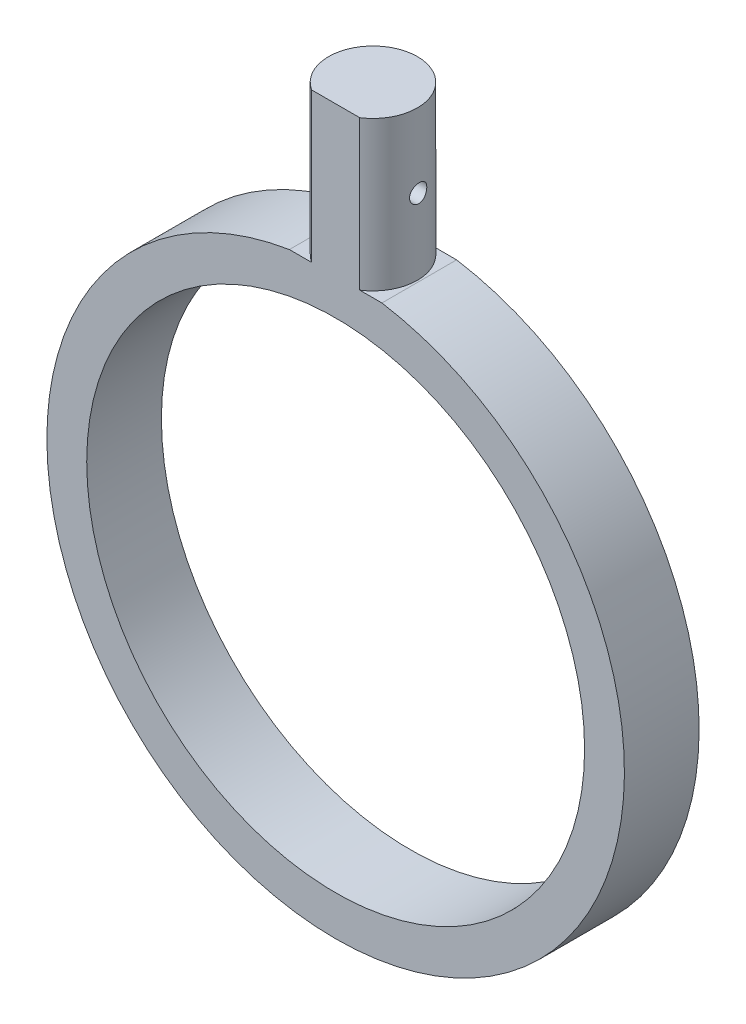
ISO-10303-21;
HEADER;
FILE_DESCRIPTION(('STEP AP214'),'2;1');
FILE_NAME('part.step','',(''),(''),'','','');
FILE_SCHEMA(('AUTOMOTIVE_DESIGN { 1 0 10303 214 1 1 1 1 }'));
ENDSEC;
DATA;
#1=APPLICATION_CONTEXT('core data for automotive mechanical design processes');
#2=APPLICATION_PROTOCOL_DEFINITION('international standard','automotive_design',2000,#1);
#3=PRODUCT_CONTEXT('',#1,'mechanical');
#4=PRODUCT('Part','Part','',(#3));
#5=PRODUCT_RELATED_PRODUCT_CATEGORY('part','',(#4));
#6=PRODUCT_DEFINITION_FORMATION('','',#4);
#7=PRODUCT_DEFINITION_CONTEXT('part definition',#1,'design');
#8=PRODUCT_DEFINITION('design','',#6,#7);
#9=PRODUCT_DEFINITION_SHAPE('','',#8);
#10=(LENGTH_UNIT() NAMED_UNIT(*) SI_UNIT(.MILLI.,.METRE.));
#11=(NAMED_UNIT(*) PLANE_ANGLE_UNIT() SI_UNIT($,.RADIAN.));
#12=(NAMED_UNIT(*) SI_UNIT($,.STERADIAN.) SOLID_ANGLE_UNIT());
#13=UNCERTAINTY_MEASURE_WITH_UNIT(LENGTH_MEASURE(1.E-05),#10,'distance_accuracy_value','');
#14=(GEOMETRIC_REPRESENTATION_CONTEXT(3) GLOBAL_UNCERTAINTY_ASSIGNED_CONTEXT((#13)) GLOBAL_UNIT_ASSIGNED_CONTEXT((#10,
#11,#12)) REPRESENTATION_CONTEXT('',''));
#15=CARTESIAN_POINT('',(0.,0.,0.));
#16=DIRECTION('',(0.,0.,1.));
#17=DIRECTION('',(1.,0.,0.));
#18=AXIS2_PLACEMENT_3D('',#15,#16,#17);
#19=CARTESIAN_POINT('',(-5.90061822503006,36.35425153352,9.525));
#20=DIRECTION('',(0.,-1.,0.));
#21=DIRECTION('',(0.,0.,-1.));
#22=AXIS2_PLACEMENT_3D('',#19,#20,#21);
#23=PLANE('',#22);
#24=CARTESIAN_POINT('',(0.,36.35425153352,4.7625));
#25=DIRECTION('',(0.,-1.,0.));
#26=DIRECTION('',(0.,0.,-1.));
#27=AXIS2_PLACEMENT_3D('',#24,#25,#26);
#28=CIRCLE('',#27,5.66500434759974);
#29=CARTESIAN_POINT('',(-3.0677138080864,36.35425153352,0.));
#30=VERTEX_POINT('',#29);
#31=CARTESIAN_POINT('',(-3.06771380808641,36.35425153352,9.525));
#32=VERTEX_POINT('',#31);
#33=EDGE_CURVE('E11',#30,#32,#28,.F.);
#34=ORIENTED_EDGE('',*,*,#33,.F.);
#35=DIRECTION('',(-1.,0.,0.));
#36=VECTOR('',#35,1.);
#37=CARTESIAN_POINT('',(-5.90061822503006,36.35425153352,0.));
#38=LINE('',#37,#36);
#39=CARTESIAN_POINT('',(-5.90061822503006,36.35425153352,0.));
#40=VERTEX_POINT('',#39);
#41=EDGE_CURVE('E73',#30,#40,#38,.T.);
#42=ORIENTED_EDGE('',*,*,#41,.T.);
#43=DIRECTION('',(0.,0.,-1.));
#44=VECTOR('',#43,1.);
#45=CARTESIAN_POINT('',(-5.90061822503006,36.35425153352,9.525));
#46=LINE('',#45,#44);
#47=CARTESIAN_POINT('',(-5.90061822503006,36.35425153352,9.525));
#48=VERTEX_POINT('',#47);
#49=EDGE_CURVE('E75',#48,#40,#46,.T.);
#50=ORIENTED_EDGE('',*,*,#49,.F.);
#51=DIRECTION('',(-1.,0.,0.));
#52=VECTOR('',#51,1.);
#53=CARTESIAN_POINT('',(-5.90061822503006,36.35425153352,9.525));
#54=LINE('',#53,#52);
#55=EDGE_CURVE('E59',#32,#48,#54,.T.);
#56=ORIENTED_EDGE('',*,*,#55,.F.);
#57=EDGE_LOOP('',(#34,#42,#50,#56));
#58=FACE_BOUND('',#57,.T.);
#59=ADVANCED_FACE('F33',(#58),#23,.F.);
#60=CARTESIAN_POINT('',(0.,36.35425153352,4.7625));
#61=DIRECTION('',(0.,1.,0.));
#62=DIRECTION('',(0.,0.,1.));
#63=AXIS2_PLACEMENT_3D('',#60,#61,#62);
#64=CIRCLE('',#63,5.66500434759974);
#65=CARTESIAN_POINT('',(3.06771380808641,36.35425153352,9.525));
#66=VERTEX_POINT('',#65);
#67=CARTESIAN_POINT('',(3.0677138080864,36.35425153352,0.));
#68=VERTEX_POINT('',#67);
#69=EDGE_CURVE('E161',#66,#68,#64,.T.);
#70=ORIENTED_EDGE('',*,*,#69,.F.);
#71=CARTESIAN_POINT('',(5.90061822503006,36.35425153352,9.525));
#72=VERTEX_POINT('',#71);
#73=EDGE_CURVE('E88',#72,#66,#54,.T.);
#74=ORIENTED_EDGE('',*,*,#73,.F.);
#75=DIRECTION('',(0.,0.,-1.));
#76=VECTOR('',#75,1.);
#77=CARTESIAN_POINT('',(5.90061822503006,36.35425153352,9.525));
#78=LINE('',#77,#76);
#79=CARTESIAN_POINT('',(5.90061822503006,36.35425153352,0.));
#80=VERTEX_POINT('',#79);
#81=EDGE_CURVE('E46',#72,#80,#78,.T.);
#82=ORIENTED_EDGE('',*,*,#81,.T.);
#83=EDGE_CURVE('E83',#80,#68,#38,.T.);
#84=ORIENTED_EDGE('',*,*,#83,.T.);
#85=EDGE_LOOP('',(#70,#74,#82,#84));
#86=FACE_BOUND('',#85,.T.);
#87=ADVANCED_FACE('F131',(#86),#23,.F.);
#88=CARTESIAN_POINT('',(0.,0.,9.525));
#89=DIRECTION('',(0.,0.,1.));
#90=DIRECTION('',(1.,0.,0.));
#91=AXIS2_PLACEMENT_3D('',#88,#89,#90);
#92=PLANE('',#91);
#93=CARTESIAN_POINT('',(0.,0.,9.525));
#94=DIRECTION('',(0.,0.,1.));
#95=DIRECTION('',(1.,0.,0.));
#96=AXIS2_PLACEMENT_3D('',#93,#94,#95);
#97=CIRCLE('',#96,36.83);
#98=EDGE_CURVE('E87',#48,#72,#97,.T.);
#99=ORIENTED_EDGE('',*,*,#98,.T.);
#100=ORIENTED_EDGE('',*,*,#73,.T.);
#101=DIRECTION('',(0.,-1.,0.));
#102=VECTOR('',#101,1.);
#103=CARTESIAN_POINT('',(3.06771380808641,55.40425153352,9.525));
#104=LINE('',#103,#102);
#105=CARTESIAN_POINT('',(3.06771380808641,55.40425153352,9.525));
#106=VERTEX_POINT('',#105);
#107=EDGE_CURVE('E150',#106,#66,#104,.T.);
#108=ORIENTED_EDGE('',*,*,#107,.F.);
#109=DIRECTION('',(1.,0.,0.));
#110=VECTOR('',#109,1.);
#111=CARTESIAN_POINT('',(-3.06771380808641,55.40425153352,9.525));
#112=LINE('',#111,#110);
#113=CARTESIAN_POINT('',(-3.06771380808641,55.40425153352,9.525));
#114=VERTEX_POINT('',#113);
#115=EDGE_CURVE('E169',#114,#106,#112,.T.);
#116=ORIENTED_EDGE('',*,*,#115,.F.);
#117=DIRECTION('',(0.,-1.,0.));
#118=VECTOR('',#117,1.);
#119=CARTESIAN_POINT('',(-3.06771380808641,55.40425153352,9.525));
#120=LINE('',#119,#118);
#121=EDGE_CURVE('E54',#114,#32,#120,.T.);
#122=ORIENTED_EDGE('',*,*,#121,.T.);
#123=ORIENTED_EDGE('',*,*,#55,.T.);
#124=EDGE_LOOP('',(#99,#100,#108,#116,#122,#123));
#125=FACE_BOUND('',#124,.T.);
#126=CARTESIAN_POINT('',(0.,0.,9.525));
#127=DIRECTION('',(0.,0.,1.));
#128=DIRECTION('',(1.,0.,0.));
#129=AXIS2_PLACEMENT_3D('',#126,#127,#128);
#130=CIRCLE('',#129,31.75);
#131=CARTESIAN_POINT('',(31.75,0.,9.525));
#132=VERTEX_POINT('',#131);
#133=EDGE_CURVE('E94',#132,#132,#130,.T.);
#134=ORIENTED_EDGE('',*,*,#133,.F.);
#135=EDGE_LOOP('',(#134));
#136=FACE_BOUND('',#135,.T.);
#137=ADVANCED_FACE('F135',(#125,#136),#92,.T.);
#138=CARTESIAN_POINT('',(0.,0.,0.));
#139=DIRECTION('',(0.,0.,1.));
#140=DIRECTION('',(1.,0.,0.));
#141=AXIS2_PLACEMENT_3D('',#138,#139,#140);
#142=PLANE('',#141);
#143=CARTESIAN_POINT('',(0.,0.,0.));
#144=DIRECTION('',(0.,0.,1.));
#145=DIRECTION('',(1.,0.,0.));
#146=AXIS2_PLACEMENT_3D('',#143,#144,#145);
#147=CIRCLE('',#146,36.83);
#148=EDGE_CURVE('E81',#40,#80,#147,.T.);
#149=ORIENTED_EDGE('',*,*,#148,.F.);
#150=ORIENTED_EDGE('',*,*,#41,.F.);
#151=EDGE_CURVE('E80',#68,#30,#38,.T.);
#152=ORIENTED_EDGE('',*,*,#151,.F.);
#153=ORIENTED_EDGE('',*,*,#83,.F.);
#154=EDGE_LOOP('',(#149,#150,#152,#153));
#155=FACE_BOUND('',#154,.T.);
#156=CARTESIAN_POINT('',(0.,0.,0.));
#157=DIRECTION('',(0.,0.,1.));
#158=DIRECTION('',(1.,0.,0.));
#159=AXIS2_PLACEMENT_3D('',#156,#157,#158);
#160=CIRCLE('',#159,31.75);
#161=CARTESIAN_POINT('',(31.75,0.,0.));
#162=VERTEX_POINT('',#161);
#163=EDGE_CURVE('E97',#162,#162,#160,.T.);
#164=ORIENTED_EDGE('',*,*,#163,.T.);
#165=EDGE_LOOP('',(#164));
#166=FACE_BOUND('',#165,.T.);
#167=ADVANCED_FACE('F90',(#155,#166),#142,.F.);
#168=CARTESIAN_POINT('',(0.,0.,9.525));
#169=DIRECTION('',(0.,0.,-1.));
#170=DIRECTION('',(-1.,0.,0.));
#171=AXIS2_PLACEMENT_3D('',#168,#169,#170);
#172=CYLINDRICAL_SURFACE('',#171,36.83);
#173=ORIENTED_EDGE('',*,*,#148,.T.);
#174=ORIENTED_EDGE('',*,*,#81,.F.);
#175=ORIENTED_EDGE('',*,*,#98,.F.);
#176=ORIENTED_EDGE('',*,*,#49,.T.);
#177=EDGE_LOOP('',(#173,#174,#175,#176));
#178=FACE_BOUND('',#177,.T.);
#179=ADVANCED_FACE('F35',(#178),#172,.T.);
#180=CARTESIAN_POINT('',(0.,0.,9.525));
#181=DIRECTION('',(0.,0.,-1.));
#182=DIRECTION('',(-1.,0.,0.));
#183=AXIS2_PLACEMENT_3D('',#180,#181,#182);
#184=CYLINDRICAL_SURFACE('',#183,31.75);
#185=ORIENTED_EDGE('',*,*,#133,.T.);
#186=EDGE_LOOP('',(#185));
#187=FACE_BOUND('',#186,.T.);
#188=ORIENTED_EDGE('',*,*,#163,.F.);
#189=EDGE_LOOP('',(#188));
#190=FACE_BOUND('',#189,.T.);
#191=ADVANCED_FACE('F121',(#187,#190),#184,.F.);
#192=CARTESIAN_POINT('',(0.,36.35425153352,4.7625));
#193=DIRECTION('',(0.,1.,0.));
#194=DIRECTION('',(0.,0.,1.));
#195=AXIS2_PLACEMENT_3D('',#192,#193,#194);
#196=PLANE('',#195);
#197=EDGE_CURVE('E166',#68,#30,#64,.T.);
#198=ORIENTED_EDGE('',*,*,#197,.F.);
#199=ORIENTED_EDGE('',*,*,#151,.T.);
#200=EDGE_LOOP('',(#198,#199));
#201=FACE_BOUND('',#200,.T.);
#202=ADVANCED_FACE('F119',(#201),#196,.F.);
#203=CARTESIAN_POINT('',(0.,55.40425153352,4.7625));
#204=DIRECTION('',(0.,-1.,0.));
#205=DIRECTION('',(0.,0.,-1.));
#206=AXIS2_PLACEMENT_3D('',#203,#204,#205);
#207=CYLINDRICAL_SURFACE('',#206,5.66500434759974);
#208=CARTESIAN_POINT('',(-5.49967831439335,45.87925153352,3.40389310449438));
#209=CARTESIAN_POINT('',(-5.49967968810176,45.9423944289808,3.40389547755812));
#210=CARTESIAN_POINT('',(-5.50098364908495,46.0055665163625,3.40914399843017));
#211=CARTESIAN_POINT('',(-5.50606537275547,46.1301123965662,3.42997274703774));
#212=CARTESIAN_POINT('',(-5.50984511549738,46.1914847089024,3.44556124449703));
#213=CARTESIAN_POINT('',(-5.51947826607893,46.3106009676439,3.48654022563374));
#214=CARTESIAN_POINT('',(-5.52532908729954,46.3683493346465,3.51191848617654));
#215=CARTESIAN_POINT('',(-5.53852225666578,46.4787608923964,3.57171090029407));
#216=CARTESIAN_POINT('',(-5.54586456356756,46.5314242237,3.60612480401503));
#217=CARTESIAN_POINT('',(-5.56148353497689,46.6312138738476,3.68372070804634));
#218=CARTESIAN_POINT('',(-5.56977444927067,46.6782255577375,3.72704725567341));
#219=CARTESIAN_POINT('',(-5.58640845301775,46.7643864325314,3.8209145341549));
#220=CARTESIAN_POINT('',(-5.59475154830714,46.8035347271483,3.87145608627011));
#221=CARTESIAN_POINT('',(-5.61087527483807,46.8734894664358,3.97932016078482));
#222=CARTESIAN_POINT('',(-5.61864432413891,46.9041472689832,4.03674099146528));
#223=CARTESIAN_POINT('',(-5.63277524884618,46.9553291388651,4.15609737143259));
#224=CARTESIAN_POINT('',(-5.6391372304492,46.9758539711164,4.21803257953332));
#225=CARTESIAN_POINT('',(-5.64986791798874,47.0059236046646,4.34391997754977));
#226=CARTESIAN_POINT('',(-5.65425883962341,47.0155927266412,4.40784053041978));
#227=CARTESIAN_POINT('',(-5.6608610640899,47.0240205405033,4.53650587360143));
#228=CARTESIAN_POINT('',(-5.66307265238346,47.0227806615243,4.60125055483832));
#229=CARTESIAN_POINT('',(-5.66525142370763,47.0095250683978,4.7283725218037));
#230=CARTESIAN_POINT('',(-5.66526188270194,46.9977217153504,4.79077132522112));
#231=CARTESIAN_POINT('',(-5.66334062430747,46.9639710888184,4.91272873649815));
#232=CARTESIAN_POINT('',(-5.66140890405797,46.9420238003923,4.97228734017416));
#233=CARTESIAN_POINT('',(-5.65600143147995,46.8886427094855,5.08686650177849));
#234=CARTESIAN_POINT('',(-5.65252655105492,46.8572142671785,5.14188960153467));
#235=CARTESIAN_POINT('',(-5.64457923446384,46.7857550974,5.24595331934575));
#236=CARTESIAN_POINT('',(-5.64010670510261,46.7457235662856,5.29499337783358));
#237=CARTESIAN_POINT('',(-5.63072664216012,46.6574892663808,5.38647248202236));
#238=CARTESIAN_POINT('',(-5.62581358805047,46.609172894777,5.42880143063628));
#239=CARTESIAN_POINT('',(-5.61629227140629,46.5061214693856,5.50479818630151));
#240=CARTESIAN_POINT('',(-5.61168402042105,46.4513861725965,5.53846566530092));
#241=CARTESIAN_POINT('',(-5.60337467018068,46.3366471342233,5.59636528281024));
#242=CARTESIAN_POINT('',(-5.59967921559072,46.2766135807339,5.62053923068463));
#243=CARTESIAN_POINT('',(-5.5937415835717,46.1532660603676,5.65843564199708));
#244=CARTESIAN_POINT('',(-5.59149928469621,46.0899523681037,5.67215897885408));
#245=CARTESIAN_POINT('',(-5.58879288681063,45.9625609905609,5.68864165812646));
#246=CARTESIAN_POINT('',(-5.58831015009869,45.8984985671376,5.69151592809968));
#247=CARTESIAN_POINT('',(-5.58913678684149,45.7708067333578,5.6865294077099));
#248=CARTESIAN_POINT('',(-5.59044608907826,45.7071773058946,5.67866904395525));
#249=CARTESIAN_POINT('',(-5.59466301874719,45.5826196323879,5.65255113265682));
#250=CARTESIAN_POINT('',(-5.5975592911188,45.5216754812531,5.63436741757374));
#251=CARTESIAN_POINT('',(-5.60455564527891,45.4036961018975,5.58819494936092));
#252=CARTESIAN_POINT('',(-5.60865580746952,45.3466611350665,5.56020554133133));
#253=CARTESIAN_POINT('',(-5.61755669712047,45.2375385807343,5.49490878491876));
#254=CARTESIAN_POINT('',(-5.62236355955683,45.1855016900481,5.45751756200251));
#255=CARTESIAN_POINT('',(-5.63199526952111,45.0883905923079,5.37458013174783));
#256=CARTESIAN_POINT('',(-5.63682011819757,45.0433168379756,5.32903339457833));
#257=CARTESIAN_POINT('',(-5.64585158420208,44.9610029456652,5.23057590275894));
#258=CARTESIAN_POINT('',(-5.65005226573918,44.9238367269653,5.17760273861664));
#259=CARTESIAN_POINT('',(-5.65713951520133,44.858932533587,5.06608430348951));
#260=CARTESIAN_POINT('',(-5.66002617324099,44.831193912405,5.00753941494176));
#261=CARTESIAN_POINT('',(-5.6639518224276,44.786173969273,4.88708163362262));
#262=CARTESIAN_POINT('',(-5.66500675045077,44.7688033207376,4.82520267074822));
#263=CARTESIAN_POINT('',(-5.66500193826733,44.7446647557998,4.69941284501931));
#264=CARTESIAN_POINT('',(-5.66394240935633,44.7378957801034,4.63550218581827));
#265=CARTESIAN_POINT('',(-5.65965598085957,44.7351570529802,4.50842393640617));
#266=CARTESIAN_POINT('',(-5.65645962465915,44.739037475215,4.44525846616046));
#267=CARTESIAN_POINT('',(-5.64808544322263,44.7571144643829,4.32055918305638));
#268=CARTESIAN_POINT('',(-5.64290756829596,44.7713112900285,4.25902541115752));
#269=CARTESIAN_POINT('',(-5.63091276564879,44.8096443728062,4.13899978367624));
#270=CARTESIAN_POINT('',(-5.62408850300274,44.8338254644958,4.08052300749534));
#271=CARTESIAN_POINT('',(-5.60936361914601,44.8914129677896,3.96845177098693));
#272=CARTESIAN_POINT('',(-5.60146287844813,44.9248204039256,3.91485785375192));
#273=CARTESIAN_POINT('',(-5.58509031605246,45.0007263608747,3.81288704578071));
#274=CARTESIAN_POINT('',(-5.57661009388713,45.0433976347739,3.76464003560584));
#275=CARTESIAN_POINT('',(-5.56000958406222,45.1362731991482,3.67594177592431));
#276=CARTESIAN_POINT('',(-5.55188938190124,45.186479266726,3.63549237066037));
#277=CARTESIAN_POINT('',(-5.53673057682598,45.2935484516236,3.56322204692106));
#278=CARTESIAN_POINT('',(-5.52970182716205,45.3504648733907,3.53147795036669));
#279=CARTESIAN_POINT('',(-5.51754469109841,45.4689989951828,3.47808144822508));
#280=CARTESIAN_POINT('',(-5.51241444759204,45.5306120294633,3.45641917528774));
#281=CARTESIAN_POINT('',(-5.50562400202964,45.6401984653349,3.42813615967468));
#282=CARTESIAN_POINT('',(-5.50340694536764,45.6875193192711,3.41906216219668));
#283=CARTESIAN_POINT('',(-5.5004336136003,45.7829716619601,3.40693987750764));
#284=CARTESIAN_POINT('',(-5.49967726689794,45.8311031108648,3.40389129495944));
#285=CARTESIAN_POINT('',(-5.49967831439335,45.87925153352,3.40389310449438));
#286=B_SPLINE_CURVE_WITH_KNOTS('',3,(#208,#209,#210,#211,#212,#213,#214,#215,#216,#217,#218,
#219,#220,#221,#222,#223,#224,#225,#226,#227,#228,#229,#230,#231,#232,#233,#234,#235,#236,#237,
#238,#239,#240,#241,#242,#243,#244,#245,#246,#247,#248,#249,#250,#251,#252,#253,#254,#255,#256,
#257,#258,#259,#260,#261,#262,#263,#264,#265,#266,#267,#268,#269,#270,#271,#272,#273,#274,#275,
#276,#277,#278,#279,#280,#281,#282,#283,#284,#285),.UNSPECIFIED.,.T.,.F.,(4,2,2,2,2,2,2,2,2,2,2,
2,2,2,2,2,2,2,2,2,2,2,2,2,2,2,2,2,2,2,2,2,2,2,2,2,2,2,4),(0.,0.189251316017271,
0.378654174565081,0.567821313179407,0.756983221491514,0.949496641679928,1.14203199255152,
1.33775104026189,1.53345531128966,1.72689473849694,1.92030882451676,2.10991987236222,
2.29953119949575,2.4890355300539,2.67855757053966,2.87092356578297,3.06329684578786,
3.25683153139351,3.45035004039299,3.64181269895604,3.83326774876448,4.02337045991658,
4.21348587001628,4.40536154205733,4.59724968401734,4.7908596191283,4.98445627463621,
5.17635995039078,5.3682444503591,5.55744321989814,5.74664673428855,5.93670927424863,
6.12679292803791,6.32078376981389,6.51482043699844,6.7105180205942,6.90602366485007,
7.05034075630549,7.19465077384859),.UNSPECIFIED.);
#287=CARTESIAN_POINT('',(-5.49967831439335,45.87925153352,3.40389310449438));
#288=VERTEX_POINT('',#287);
#289=EDGE_CURVE('E37',#288,#288,#286,.T.);
#290=ORIENTED_EDGE('',*,*,#289,.T.);
#291=EDGE_LOOP('',(#290));
#292=FACE_BOUND('',#291,.T.);
#293=CARTESIAN_POINT('',(5.49967831439337,45.87925153352,3.40389310449438));
#294=CARTESIAN_POINT('',(5.49967968810178,45.8161086380593,3.40389547755812));
#295=CARTESIAN_POINT('',(5.50098364908496,45.7529365506775,3.40914399843017));
#296=CARTESIAN_POINT('',(5.50606537275546,45.6283906704739,3.42997274703774));
#297=CARTESIAN_POINT('',(5.50984511549738,45.5670183581377,3.44556124449703));
#298=CARTESIAN_POINT('',(5.51947826607893,45.4479020993962,3.48654022563374));
#299=CARTESIAN_POINT('',(5.52532908729954,45.3901537323935,3.51191848617654));
#300=CARTESIAN_POINT('',(5.53852225666578,45.2797421746437,3.57171090029407));
#301=CARTESIAN_POINT('',(5.54586456356756,45.2270788433401,3.60612480401503));
#302=CARTESIAN_POINT('',(5.56148353497689,45.1272891931925,3.68372070804634));
#303=CARTESIAN_POINT('',(5.56977444927067,45.0802775093026,3.72704725567341));
#304=CARTESIAN_POINT('',(5.58640845301775,44.9941166345087,3.8209145341549));
#305=CARTESIAN_POINT('',(5.59475154830714,44.9549683398917,3.87145608627011));
#306=CARTESIAN_POINT('',(5.61087527483807,44.8850136006042,3.97932016078482));
#307=CARTESIAN_POINT('',(5.61864432413891,44.8543557980569,4.03674099146528));
#308=CARTESIAN_POINT('',(5.63277524884618,44.803173928175,4.15609737143259));
#309=CARTESIAN_POINT('',(5.6391372304492,44.7826490959237,4.21803257953332));
#310=CARTESIAN_POINT('',(5.64986791798874,44.7525794623755,4.34391997754977));
#311=CARTESIAN_POINT('',(5.65425883962341,44.7429103403988,4.40784053041978));
#312=CARTESIAN_POINT('',(5.6608610640899,44.7344825265367,4.53650587360143));
#313=CARTESIAN_POINT('',(5.66307265238346,44.7357224055158,4.60125055483832));
#314=CARTESIAN_POINT('',(5.66525142370763,44.7489779986422,4.7283725218037));
#315=CARTESIAN_POINT('',(5.66526188270194,44.7607813516897,4.79077132522112));
#316=CARTESIAN_POINT('',(5.66334062430747,44.7945319782217,4.91272873649815));
#317=CARTESIAN_POINT('',(5.66140890405797,44.8164792666478,4.97228734017416));
#318=CARTESIAN_POINT('',(5.65600143147995,44.8698603575545,5.08686650177849));
#319=CARTESIAN_POINT('',(5.65252655105492,44.9012887998616,5.14188960153467));
#320=CARTESIAN_POINT('',(5.64457923446384,44.9727479696401,5.24595331934575));
#321=CARTESIAN_POINT('',(5.64010670510261,45.0127795007545,5.29499337783358));
#322=CARTESIAN_POINT('',(5.63072664216012,45.1010138006592,5.38647248202237));
#323=CARTESIAN_POINT('',(5.62581358805047,45.149330172263,5.42880143063629));
#324=CARTESIAN_POINT('',(5.61629227140629,45.2523815976544,5.50479818630151));
#325=CARTESIAN_POINT('',(5.61168402042105,45.3071168944436,5.53846566530092));
#326=CARTESIAN_POINT('',(5.60337467018068,45.4218559328168,5.59636528281024));
#327=CARTESIAN_POINT('',(5.59967921559072,45.4818894863062,5.62053923068463));
#328=CARTESIAN_POINT('',(5.5937415835717,45.6052370066725,5.65843564199708));
#329=CARTESIAN_POINT('',(5.59149928469621,45.6685506989364,5.67215897885408));
#330=CARTESIAN_POINT('',(5.58879288681063,45.7959420764791,5.68864165812646));
#331=CARTESIAN_POINT('',(5.58831015009869,45.8600044999025,5.69151592809968));
#332=CARTESIAN_POINT('',(5.58913678684149,45.9876963336822,5.6865294077099));
#333=CARTESIAN_POINT('',(5.59044608907826,46.0513257611455,5.67866904395525));
#334=CARTESIAN_POINT('',(5.59466301874719,46.1758834346522,5.65255113265682));
#335=CARTESIAN_POINT('',(5.5975592911188,46.236827585787,5.63436741757374));
#336=CARTESIAN_POINT('',(5.60455564527891,46.3548069651426,5.58819494936092));
#337=CARTESIAN_POINT('',(5.60865580746952,46.4118419319736,5.56020554133133));
#338=CARTESIAN_POINT('',(5.61755669712047,46.5209644863058,5.49490878491876));
#339=CARTESIAN_POINT('',(5.62236355955683,46.573001376992,5.45751756200251));
#340=CARTESIAN_POINT('',(5.63199526952111,46.6701124747321,5.37458013174783));
#341=CARTESIAN_POINT('',(5.63682011819757,46.7151862290645,5.32903339457833));
#342=CARTESIAN_POINT('',(5.64585158420208,46.7975001213749,5.23057590275894));
#343=CARTESIAN_POINT('',(5.65005226573918,46.8346663400747,5.17760273861664));
#344=CARTESIAN_POINT('',(5.65713951520134,46.8995705334531,5.06608430348951));
#345=CARTESIAN_POINT('',(5.66002617324099,46.927309154635,5.00753941494176));
#346=CARTESIAN_POINT('',(5.6639518224276,46.9723290977671,4.88708163362262));
#347=CARTESIAN_POINT('',(5.66500675045077,46.9896997463025,4.82520267074822));
#348=CARTESIAN_POINT('',(5.66500193826733,47.0138383112402,4.69941284501931));
#349=CARTESIAN_POINT('',(5.66394240935633,47.0206072869367,4.63550218581826));
#350=CARTESIAN_POINT('',(5.65965598085957,47.0233460140598,4.50842393640617));
#351=CARTESIAN_POINT('',(5.65645962465915,47.019465591825,4.44525846616046));
#352=CARTESIAN_POINT('',(5.64808544322263,47.0013886026572,4.32055918305638));
#353=CARTESIAN_POINT('',(5.64290756829596,46.9871917770116,4.25902541115752));
#354=CARTESIAN_POINT('',(5.63091276564879,46.9488586942338,4.13899978367624));
#355=CARTESIAN_POINT('',(5.62408850300274,46.9246776025443,4.08052300749534));
#356=CARTESIAN_POINT('',(5.60936361914601,46.8670900992504,3.96845177098693));
#357=CARTESIAN_POINT('',(5.60146287844813,46.8336826631144,3.91485785375192));
#358=CARTESIAN_POINT('',(5.58509031605246,46.7577767061654,3.81288704578071));
#359=CARTESIAN_POINT('',(5.57661009388714,46.7151054322662,3.76464003560584));
#360=CARTESIAN_POINT('',(5.56000958406222,46.6222298678919,3.67594177592431));
#361=CARTESIAN_POINT('',(5.55188938190123,46.572023800314,3.63549237066037));
#362=CARTESIAN_POINT('',(5.53673057682597,46.4649546154164,3.56322204692106));
#363=CARTESIAN_POINT('',(5.52970182716205,46.4080381936494,3.53147795036669));
#364=CARTESIAN_POINT('',(5.51754469109842,46.2895040718573,3.47808144822508));
#365=CARTESIAN_POINT('',(5.51241444759204,46.2278910375767,3.45641917528774));
#366=CARTESIAN_POINT('',(5.50562400202963,46.1183046017051,3.42813615967468));
#367=CARTESIAN_POINT('',(5.50340694536763,46.0709837477689,3.41906216219668));
#368=CARTESIAN_POINT('',(5.5004336136003,45.9755314050799,3.40693987750764));
#369=CARTESIAN_POINT('',(5.49967726689796,45.9273999561753,3.40389129495944));
#370=CARTESIAN_POINT('',(5.49967831439337,45.87925153352,3.40389310449438));
#371=B_SPLINE_CURVE_WITH_KNOTS('',3,(#293,#294,#295,#296,#297,#298,#299,#300,#301,#302,#303,
#304,#305,#306,#307,#308,#309,#310,#311,#312,#313,#314,#315,#316,#317,#318,#319,#320,#321,#322,
#323,#324,#325,#326,#327,#328,#329,#330,#331,#332,#333,#334,#335,#336,#337,#338,#339,#340,#341,
#342,#343,#344,#345,#346,#347,#348,#349,#350,#351,#352,#353,#354,#355,#356,#357,#358,#359,#360,
#361,#362,#363,#364,#365,#366,#367,#368,#369,#370),.UNSPECIFIED.,.T.,.F.,(4,2,2,2,2,2,2,2,2,2,2,
2,2,2,2,2,2,2,2,2,2,2,2,2,2,2,2,2,2,2,2,2,2,2,2,2,2,2,4),(0.,0.189251316017271,0.37865417456508,
0.567821313179406,0.756983221491514,0.949496641679933,1.14203199255152,1.33775104026189,
1.53345531128966,1.72689473849694,1.92030882451676,2.10991987236222,2.29953119949575,
2.4890355300539,2.67855757053966,2.87092356578297,3.06329684578786,3.25683153139351,
3.45035004039299,3.64181269895605,3.83326774876448,4.02337045991658,4.21348587001628,
4.40536154205733,4.59724968401735,4.7908596191283,4.98445627463621,5.17635995039078,
5.3682444503591,5.55744321989814,5.74664673428855,5.93670927424863,6.12679292803791,
6.32078376981389,6.51482043699844,6.7105180205942,6.90602366485007,7.05034075630549,
7.19465077384859),.UNSPECIFIED.);
#372=CARTESIAN_POINT('',(5.49967831439337,45.87925153352,3.40389310449438));
#373=VERTEX_POINT('',#372);
#374=EDGE_CURVE('E102',#373,#373,#371,.T.);
#375=ORIENTED_EDGE('',*,*,#374,.T.);
#376=EDGE_LOOP('',(#375));
#377=FACE_BOUND('',#376,.T.);
#378=ORIENTED_EDGE('',*,*,#69,.T.);
#379=ORIENTED_EDGE('',*,*,#197,.T.);
#380=ORIENTED_EDGE('',*,*,#33,.T.);
#381=ORIENTED_EDGE('',*,*,#121,.F.);
#382=CARTESIAN_POINT('',(0.,55.40425153352,4.7625));
#383=DIRECTION('',(0.,1.,0.));
#384=DIRECTION('',(0.,0.,1.));
#385=AXIS2_PLACEMENT_3D('',#382,#383,#384);
#386=CIRCLE('',#385,5.66500434759974);
#387=EDGE_CURVE('E165',#106,#114,#386,.T.);
#388=ORIENTED_EDGE('',*,*,#387,.F.);
#389=ORIENTED_EDGE('',*,*,#107,.T.);
#390=EDGE_LOOP('',(#378,#379,#380,#381,#388,#389));
#391=FACE_BOUND('',#390,.T.);
#392=ADVANCED_FACE('F106',(#292,#377,#391),#207,.T.);
#393=CARTESIAN_POINT('',(0.,55.40425153352,4.7625));
#394=DIRECTION('',(0.,1.,0.));
#395=DIRECTION('',(0.,0.,1.));
#396=AXIS2_PLACEMENT_3D('',#393,#394,#395);
#397=PLANE('',#396);
#398=ORIENTED_EDGE('',*,*,#387,.T.);
#399=ORIENTED_EDGE('',*,*,#115,.T.);
#400=EDGE_LOOP('',(#398,#399));
#401=FACE_BOUND('',#400,.T.);
#402=ADVANCED_FACE('F114',(#401),#397,.T.);
#403=CARTESIAN_POINT('',(-36.83,45.87925153352,4.54689310449438));
#404=DIRECTION('',(1.,0.,0.));
#405=DIRECTION('',(0.,0.,-1.));
#406=AXIS2_PLACEMENT_3D('',#403,#404,#405);
#407=CYLINDRICAL_SURFACE('',#406,1.143);
#408=ORIENTED_EDGE('',*,*,#374,.F.);
#409=EDGE_LOOP('',(#408));
#410=FACE_BOUND('',#409,.T.);
#411=ORIENTED_EDGE('',*,*,#289,.F.);
#412=EDGE_LOOP('',(#411));
#413=FACE_BOUND('',#412,.T.);
#414=ADVANCED_FACE('F110',(#410,#413),#407,.F.);
#415=CLOSED_SHELL('',(#59,#87,#137,#167,#179,#191,#202,#392,#402,#414));
#416=MANIFOLD_SOLID_BREP('B2',#415);
#417=ADVANCED_BREP_SHAPE_REPRESENTATION('',(#18,#416),#14);
#418=SHAPE_DEFINITION_REPRESENTATION(#9,#417);
ENDSEC;
END-ISO-10303-21;
